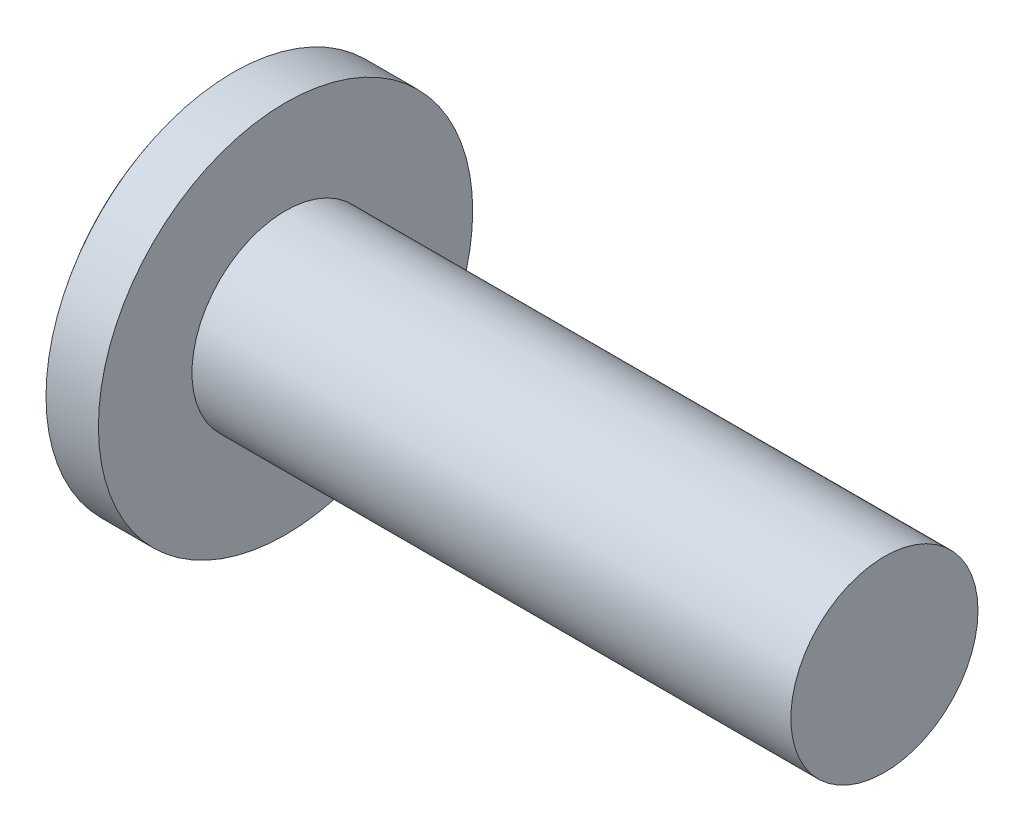
ISO-10303-21;
HEADER;
FILE_DESCRIPTION(('STEP AP214'),'2;1');
FILE_NAME('part.step','',(''),(''),'','','');
FILE_SCHEMA(('AUTOMOTIVE_DESIGN { 1 0 10303 214 1 1 1 1 }'));
ENDSEC;
DATA;
#1=APPLICATION_CONTEXT('core data for automotive mechanical design processes');
#2=APPLICATION_PROTOCOL_DEFINITION('international standard','automotive_design',2000,#1);
#3=PRODUCT_CONTEXT('',#1,'mechanical');
#4=PRODUCT('Part','Part','',(#3));
#5=PRODUCT_RELATED_PRODUCT_CATEGORY('part','',(#4));
#6=PRODUCT_DEFINITION_FORMATION('','',#4);
#7=PRODUCT_DEFINITION_CONTEXT('part definition',#1,'design');
#8=PRODUCT_DEFINITION('design','',#6,#7);
#9=PRODUCT_DEFINITION_SHAPE('','',#8);
#10=(LENGTH_UNIT() NAMED_UNIT(*) SI_UNIT(.MILLI.,.METRE.));
#11=(NAMED_UNIT(*) PLANE_ANGLE_UNIT() SI_UNIT($,.RADIAN.));
#12=(NAMED_UNIT(*) SI_UNIT($,.STERADIAN.) SOLID_ANGLE_UNIT());
#13=UNCERTAINTY_MEASURE_WITH_UNIT(LENGTH_MEASURE(1.E-05),#10,'distance_accuracy_value','');
#14=(GEOMETRIC_REPRESENTATION_CONTEXT(3) GLOBAL_UNCERTAINTY_ASSIGNED_CONTEXT((#13)) GLOBAL_UNIT_ASSIGNED_CONTEXT((#10,
#11,#12)) REPRESENTATION_CONTEXT('',''));
#15=CARTESIAN_POINT('',(0.,0.,0.));
#16=DIRECTION('',(0.,0.,1.));
#17=DIRECTION('',(1.,0.,0.));
#18=AXIS2_PLACEMENT_3D('',#15,#16,#17);
#19=CARTESIAN_POINT('',(1.5,-0.13,-0.26));
#20=DIRECTION('',(-0.569779621770595,0.,0.821797531399893));
#21=DIRECTION('',(0.821797531399893,0.,0.569779621770595));
#22=AXIS2_PLACEMENT_3D('',#19,#20,#21);
#23=PLANE('',#22);
#24=CARTESIAN_POINT('',(0.313139293097391,0.13,-1.08289009011915));
#25=CARTESIAN_POINT('',(0.311541025470173,0.0866666666666669,-1.08399822234068));
#26=CARTESIAN_POINT('',(0.310741891656564,0.0433333333333334,-1.08455228845145));
#27=CARTESIAN_POINT('',(0.310741891656564,-0.0433333333333335,-1.08455228845145));
#28=CARTESIAN_POINT('',(0.311541025470173,-0.086666666666667,-1.08399822234068));
#29=CARTESIAN_POINT('',(0.313139293097391,-0.13,-1.08289009011915));
#30=B_SPLINE_CURVE_WITH_KNOTS('',3,(#24,#25,#26,#27,#28,#29),.UNSPECIFIED.,.F.,.F.,(4,2,4),(0.,
0.130032728330081,0.260065456660161),.UNSPECIFIED.);
#31=CARTESIAN_POINT('',(0.313139293097366,0.13,-1.08289009011909));
#32=VERTEX_POINT('',#31);
#33=CARTESIAN_POINT('',(0.313139293097366,-0.13,-1.08289009011909));
#34=VERTEX_POINT('',#33);
#35=EDGE_CURVE('E21',#32,#34,#30,.T.);
#36=ORIENTED_EDGE('',*,*,#35,.T.);
#37=DIRECTION('',(-0.821797531399938,0.,-0.569779621770529));
#38=VECTOR('',#37,1.);
#39=CARTESIAN_POINT('',(1.5,-0.13,-0.26));
#40=LINE('',#39,#38);
#41=CARTESIAN_POINT('',(1.5,-0.13,-0.26));
#42=VERTEX_POINT('',#41);
#43=EDGE_CURVE('E125',#42,#34,#40,.T.);
#44=ORIENTED_EDGE('',*,*,#43,.F.);
#45=DIRECTION('',(0.,1.,0.));
#46=VECTOR('',#45,1.);
#47=CARTESIAN_POINT('',(1.5,-0.26,-0.26));
#48=LINE('',#47,#46);
#49=CARTESIAN_POINT('',(1.5,0.13,-0.26));
#50=VERTEX_POINT('',#49);
#51=EDGE_CURVE('E323',#50,#42,#48,.F.);
#52=ORIENTED_EDGE('',*,*,#51,.F.);
#53=DIRECTION('',(0.821797531399938,0.,0.569779621770529));
#54=VECTOR('',#53,1.);
#55=CARTESIAN_POINT('',(0.313139293097342,0.13,-1.08289009011904));
#56=LINE('',#55,#54);
#57=EDGE_CURVE('E128',#32,#50,#56,.T.);
#58=ORIENTED_EDGE('',*,*,#57,.F.);
#59=EDGE_LOOP('',(#36,#44,#52,#58));
#60=FACE_BOUND('',#59,.T.);
#61=ADVANCED_FACE('F17',(#60),#23,.T.);
#62=CARTESIAN_POINT('',(0.298849310573298,-1.09279781133585,-0.13));
#63=DIRECTION('',(-0.569779621770595,0.821797531399893,0.));
#64=DIRECTION('',(-0.821797531399893,-0.569779621770595,0.));
#65=AXIS2_PLACEMENT_3D('',#62,#63,#64);
#66=PLANE('',#65);
#67=DIRECTION('',(0.,0.,1.));
#68=VECTOR('',#67,1.);
#69=CARTESIAN_POINT('',(1.5,-0.259999999999999,-0.26));
#70=LINE('',#69,#68);
#71=CARTESIAN_POINT('',(1.5,-0.259999999999999,-0.13));
#72=VERTEX_POINT('',#71);
#73=CARTESIAN_POINT('',(1.5,-0.259999999999999,0.13));
#74=VERTEX_POINT('',#73);
#75=EDGE_CURVE('E338',#72,#74,#70,.T.);
#76=ORIENTED_EDGE('',*,*,#75,.F.);
#77=DIRECTION('',(0.821797531399937,0.569779621770531,0.));
#78=VECTOR('',#77,1.);
#79=CARTESIAN_POINT('',(0.313139293097331,-1.08289009011905,-0.13));
#80=LINE('',#79,#78);
#81=CARTESIAN_POINT('',(0.313139293097347,-1.08289009011911,-0.130000000000001));
#82=VERTEX_POINT('',#81);
#83=EDGE_CURVE('E289',#82,#72,#80,.T.);
#84=ORIENTED_EDGE('',*,*,#83,.F.);
#85=CARTESIAN_POINT('',(0.313139293097362,-1.08289009011917,-0.130000000000002));
#86=CARTESIAN_POINT('',(0.312340594801891,-1.08344385427069,-0.108344232257433));
#87=CARTESIAN_POINT('',(0.311741462200754,-1.08385925287415,-0.0866830150528154));
#88=CARTESIAN_POINT('',(0.310942328387147,-1.08441331898491,-0.0433496817194814));
#89=CARTESIAN_POINT('',(0.310742327174677,-1.08455198649223,-0.0216775655907653));
#90=CARTESIAN_POINT('',(0.310741891656542,-1.08455228845147,0.));
#91=B_SPLINE_CURVE_WITH_KNOTS('',3,(#85,#86,#87,#88,#89,#90),.UNSPECIFIED.,.F.,.F.,(4,2,4),(0.,
0.0650204477063345,0.130040895412669),.UNSPECIFIED.);
#92=CARTESIAN_POINT('',(0.310741891656483,-1.08455228845132,0.));
#93=VERTEX_POINT('',#92);
#94=EDGE_CURVE('E130',#82,#93,#91,.T.);
#95=ORIENTED_EDGE('',*,*,#94,.T.);
#96=CARTESIAN_POINT('',(0.310741891656541,-1.08455228845147,0.));
#97=CARTESIAN_POINT('',(0.310742327174677,-1.08455198649223,0.0216775655907652));
#98=CARTESIAN_POINT('',(0.310942328387147,-1.08441331898491,0.0433496817194814));
#99=CARTESIAN_POINT('',(0.311741462200753,-1.08385925287415,0.0866830150528153));
#100=CARTESIAN_POINT('',(0.312340594801891,-1.08344385427069,0.108344232257433));
#101=CARTESIAN_POINT('',(0.313139293097362,-1.08289009011917,0.130000000000002));
#102=B_SPLINE_CURVE_WITH_KNOTS('',3,(#96,#97,#98,#99,#100,#101),.UNSPECIFIED.,.F.,.F.,(4,2,4),
(0.,0.0650204477063345,0.130040895412669),.UNSPECIFIED.);
#103=CARTESIAN_POINT('',(0.313139293097347,-1.08289009011911,0.130000000000001));
#104=VERTEX_POINT('',#103);
#105=EDGE_CURVE('E204',#93,#104,#102,.T.);
#106=ORIENTED_EDGE('',*,*,#105,.T.);
#107=DIRECTION('',(-0.821797531399937,-0.569779621770531,0.));
#108=VECTOR('',#107,1.);
#109=CARTESIAN_POINT('',(1.5,-0.259999999999999,0.13));
#110=LINE('',#109,#108);
#111=EDGE_CURVE('E335',#74,#104,#110,.T.);
#112=ORIENTED_EDGE('',*,*,#111,.F.);
#113=EDGE_LOOP('',(#76,#84,#95,#106,#112));
#114=FACE_BOUND('',#113,.T.);
#115=ADVANCED_FACE('F189',(#114),#66,.T.);
#116=CARTESIAN_POINT('',(1.5,0.26,-0.13));
#117=DIRECTION('',(-0.569779621770595,-0.821797531399893,0.));
#118=DIRECTION('',(0.821797531399893,-0.569779621770595,0.));
#119=AXIS2_PLACEMENT_3D('',#116,#117,#118);
#120=PLANE('',#119);
#121=CARTESIAN_POINT('',(0.310741891656542,1.08455228845147,0.));
#122=CARTESIAN_POINT('',(0.310742327174677,1.08455198649223,-0.0216775655907652));
#123=CARTESIAN_POINT('',(0.310942328387147,1.08441331898491,-0.0433496817194813));
#124=CARTESIAN_POINT('',(0.311741462200754,1.08385925287415,-0.0866830150528153));
#125=CARTESIAN_POINT('',(0.312340594801891,1.08344385427069,-0.108344232257433));
#126=CARTESIAN_POINT('',(0.313139293097362,1.08289009011917,-0.130000000000002));
#127=B_SPLINE_CURVE_WITH_KNOTS('',3,(#121,#122,#123,#124,#125,#126),.UNSPECIFIED.,.F.,.F.,(4,2,
4),(0.,0.0650204477063345,0.130040895412669),.UNSPECIFIED.);
#128=CARTESIAN_POINT('',(0.310741891656483,1.08455228845132,0.));
#129=VERTEX_POINT('',#128);
#130=CARTESIAN_POINT('',(0.313139293097347,1.08289009011911,-0.130000000000001));
#131=VERTEX_POINT('',#130);
#132=EDGE_CURVE('E193',#129,#131,#127,.T.);
#133=ORIENTED_EDGE('',*,*,#132,.T.);
#134=DIRECTION('',(-0.821797531399937,0.569779621770531,0.));
#135=VECTOR('',#134,1.);
#136=CARTESIAN_POINT('',(1.5,0.26,-0.13));
#137=LINE('',#136,#135);
#138=CARTESIAN_POINT('',(1.5,0.26,-0.13));
#139=VERTEX_POINT('',#138);
#140=EDGE_CURVE('E284',#139,#131,#137,.T.);
#141=ORIENTED_EDGE('',*,*,#140,.F.);
#142=DIRECTION('',(0.,0.,1.));
#143=VECTOR('',#142,1.);
#144=CARTESIAN_POINT('',(1.5,0.26,-0.26));
#145=LINE('',#144,#143);
#146=CARTESIAN_POINT('',(1.5,0.26,0.13));
#147=VERTEX_POINT('',#146);
#148=EDGE_CURVE('E321',#147,#139,#145,.F.);
#149=ORIENTED_EDGE('',*,*,#148,.F.);
#150=DIRECTION('',(0.821797531399937,-0.569779621770531,0.));
#151=VECTOR('',#150,1.);
#152=CARTESIAN_POINT('',(0.313139293097332,1.08289009011905,0.13));
#153=LINE('',#152,#151);
#154=CARTESIAN_POINT('',(0.313139293097347,1.08289009011911,0.130000000000001));
#155=VERTEX_POINT('',#154);
#156=EDGE_CURVE('E310',#155,#147,#153,.T.);
#157=ORIENTED_EDGE('',*,*,#156,.F.);
#158=CARTESIAN_POINT('',(0.313139293097362,1.08289009011917,0.130000000000002));
#159=CARTESIAN_POINT('',(0.312340594801891,1.08344385427069,0.108344232257433));
#160=CARTESIAN_POINT('',(0.311741462200754,1.08385925287415,0.0866830150528153));
#161=CARTESIAN_POINT('',(0.310942328387147,1.08441331898492,0.0433496817194814));
#162=CARTESIAN_POINT('',(0.310742327174677,1.08455198649223,0.0216775655907653));
#163=CARTESIAN_POINT('',(0.310741891656541,1.08455228845147,0.));
#164=B_SPLINE_CURVE_WITH_KNOTS('',3,(#158,#159,#160,#161,#162,#163),.UNSPECIFIED.,.F.,.F.,(4,2,
4),(0.,0.0650204477063344,0.130040895412669),.UNSPECIFIED.);
#165=EDGE_CURVE('E198',#155,#129,#164,.T.);
#166=ORIENTED_EDGE('',*,*,#165,.T.);
#167=EDGE_LOOP('',(#133,#141,#149,#157,#166));
#168=FACE_BOUND('',#167,.T.);
#169=ADVANCED_FACE('F184',(#168),#120,.T.);
#170=CARTESIAN_POINT('',(1.5,-0.26,-0.26));
#171=DIRECTION('',(-1.,0.,0.));
#172=DIRECTION('',(0.,0.,1.));
#173=AXIS2_PLACEMENT_3D('',#170,#171,#172);
#174=PLANE('',#173);
#175=DIRECTION('',(0.,0.,-1.));
#176=VECTOR('',#175,1.);
#177=CARTESIAN_POINT('',(1.5,0.13,1.09241899102019));
#178=LINE('',#177,#176);
#179=CARTESIAN_POINT('',(1.5,0.13,0.13));
#180=VERTEX_POINT('',#179);
#181=CARTESIAN_POINT('',(1.5,0.13,0.259999999999998));
#182=VERTEX_POINT('',#181);
#183=EDGE_CURVE('E309',#180,#182,#178,.F.);
#184=ORIENTED_EDGE('',*,*,#183,.F.);
#185=DIRECTION('',(0.,1.,0.));
#186=VECTOR('',#185,1.);
#187=CARTESIAN_POINT('',(1.5,0.13,0.13));
#188=LINE('',#187,#186);
#189=EDGE_CURVE('E306',#147,#180,#188,.F.);
#190=ORIENTED_EDGE('',*,*,#189,.F.);
#191=ORIENTED_EDGE('',*,*,#148,.T.);
#192=DIRECTION('',(0.,1.,0.));
#193=VECTOR('',#192,1.);
#194=CARTESIAN_POINT('',(1.5,0.13,-0.13));
#195=LINE('',#194,#193);
#196=CARTESIAN_POINT('',(1.5,0.13,-0.13));
#197=VERTEX_POINT('',#196);
#198=EDGE_CURVE('E286',#197,#139,#195,.T.);
#199=ORIENTED_EDGE('',*,*,#198,.F.);
#200=DIRECTION('',(0.,0.,-1.));
#201=VECTOR('',#200,1.);
#202=CARTESIAN_POINT('',(1.5,0.13,-0.13));
#203=LINE('',#202,#201);
#204=EDGE_CURVE('E298',#50,#197,#203,.F.);
#205=ORIENTED_EDGE('',*,*,#204,.F.);
#206=ORIENTED_EDGE('',*,*,#51,.T.);
#207=DIRECTION('',(0.,0.,1.));
#208=VECTOR('',#207,1.);
#209=CARTESIAN_POINT('',(1.5,-0.13,-0.13));
#210=LINE('',#209,#208);
#211=CARTESIAN_POINT('',(1.5,-0.13,-0.13));
#212=VERTEX_POINT('',#211);
#213=EDGE_CURVE('E136',#212,#42,#210,.F.);
#214=ORIENTED_EDGE('',*,*,#213,.F.);
#215=DIRECTION('',(0.,1.,0.));
#216=VECTOR('',#215,1.);
#217=CARTESIAN_POINT('',(1.5,-1.09241899102019,-0.13));
#218=LINE('',#217,#216);
#219=EDGE_CURVE('E342',#72,#212,#218,.T.);
#220=ORIENTED_EDGE('',*,*,#219,.F.);
#221=ORIENTED_EDGE('',*,*,#75,.T.);
#222=DIRECTION('',(0.,1.,0.));
#223=VECTOR('',#222,1.);
#224=CARTESIAN_POINT('',(1.5,-1.09241899102019,0.13));
#225=LINE('',#224,#223);
#226=CARTESIAN_POINT('',(1.5,-0.13,0.13));
#227=VERTEX_POINT('',#226);
#228=EDGE_CURVE('E329',#227,#74,#225,.F.);
#229=ORIENTED_EDGE('',*,*,#228,.F.);
#230=DIRECTION('',(0.,0.,1.));
#231=VECTOR('',#230,1.);
#232=CARTESIAN_POINT('',(1.5,-0.13,1.09241899102019));
#233=LINE('',#232,#231);
#234=CARTESIAN_POINT('',(1.5,-0.13,0.259999999999998));
#235=VERTEX_POINT('',#234);
#236=EDGE_CURVE('E326',#235,#227,#233,.F.);
#237=ORIENTED_EDGE('',*,*,#236,.F.);
#238=DIRECTION('',(0.,1.,0.));
#239=VECTOR('',#238,1.);
#240=CARTESIAN_POINT('',(1.5,-0.13,0.259999999999996));
#241=LINE('',#240,#239);
#242=EDGE_CURVE('E317',#182,#235,#241,.F.);
#243=ORIENTED_EDGE('',*,*,#242,.F.);
#244=EDGE_LOOP('',(#184,#190,#191,#199,#205,#206,#214,#220,#221,#229,#237,#243));
#245=FACE_BOUND('',#244,.T.);
#246=ADVANCED_FACE('F180',(#245),#174,.T.);
#247=CARTESIAN_POINT('',(0.298848775638647,-0.13,1.09279818222387));
#248=DIRECTION('',(-0.569779621770595,0.,-0.821797531399893));
#249=DIRECTION('',(-0.821797531399893,0.,0.569779621770595));
#250=AXIS2_PLACEMENT_3D('',#247,#248,#249);
#251=PLANE('',#250);
#252=ORIENTED_EDGE('',*,*,#242,.T.);
#253=DIRECTION('',(0.821797531399938,0.,-0.56977962177053));
#254=VECTOR('',#253,1.);
#255=CARTESIAN_POINT('',(0.313139293097342,-0.13,1.08289009011904));
#256=LINE('',#255,#254);
#257=CARTESIAN_POINT('',(0.313139293097366,-0.13,1.08289009011909));
#258=VERTEX_POINT('',#257);
#259=EDGE_CURVE('E330',#258,#235,#256,.T.);
#260=ORIENTED_EDGE('',*,*,#259,.F.);
#261=CARTESIAN_POINT('',(0.313139293097389,-0.13,1.08289009011914));
#262=CARTESIAN_POINT('',(0.311541025470171,-0.0866666666666668,1.08399822234068));
#263=CARTESIAN_POINT('',(0.310741891656562,-0.0433333333333334,1.08455228845145));
#264=CARTESIAN_POINT('',(0.310741891656562,0.0433333333333335,1.08455228845145));
#265=CARTESIAN_POINT('',(0.311541025470171,0.0866666666666669,1.08399822234068));
#266=CARTESIAN_POINT('',(0.313139293097389,0.13,1.08289009011914));
#267=B_SPLINE_CURVE_WITH_KNOTS('',3,(#261,#262,#263,#264,#265,#266),.UNSPECIFIED.,.F.,.F.,(4,2,
4),(0.,0.13003272833008,0.260065456660161),.UNSPECIFIED.);
#268=CARTESIAN_POINT('',(0.313139293097366,0.13,1.08289009011909));
#269=VERTEX_POINT('',#268);
#270=EDGE_CURVE('E160',#258,#269,#267,.T.);
#271=ORIENTED_EDGE('',*,*,#270,.T.);
#272=DIRECTION('',(-0.821797531399938,0.,0.56977962177053));
#273=VECTOR('',#272,1.);
#274=CARTESIAN_POINT('',(1.5,0.13,0.259999999999999));
#275=LINE('',#274,#273);
#276=EDGE_CURVE('E148',#182,#269,#275,.T.);
#277=ORIENTED_EDGE('',*,*,#276,.F.);
#278=EDGE_LOOP('',(#252,#260,#271,#277));
#279=FACE_BOUND('',#278,.T.);
#280=ADVANCED_FACE('F174',(#279),#251,.T.);
#281=CARTESIAN_POINT('',(0.0373674350653901,-0.13,-0.13));
#282=DIRECTION('',(0.,1.,0.));
#283=DIRECTION('',(0.,0.,1.));
#284=AXIS2_PLACEMENT_3D('',#281,#282,#283);
#285=PLANE('',#284);
#286=ORIENTED_EDGE('',*,*,#43,.T.);
#287=CARTESIAN_POINT('',(0.037367435065386,-0.13,-0.130000000000001));
#288=CARTESIAN_POINT('',(0.0394971139768629,-0.13,-0.143668068066421));
#289=CARTESIAN_POINT('',(0.0417990975589028,-0.13,-0.15730744461169));
#290=CARTESIAN_POINT('',(0.0466746772806979,-0.13,-0.184536038525838));
#291=CARTESIAN_POINT('',(0.0492482391476004,-0.13,-0.198125262000487));
#292=CARTESIAN_POINT('',(0.0572662955433864,-0.13,-0.238826517677563));
#293=CARTESIAN_POINT('',(0.0630093634602951,-0.13,-0.265879350411103));
#294=CARTESIAN_POINT('',(0.0750458853952261,-0.13,-0.319793367199412));
#295=CARTESIAN_POINT('',(0.0813380013153635,-0.13,-0.346654853664737));
#296=CARTESIAN_POINT('',(0.0943964950787539,-0.13,-0.400264363030499));
#297=CARTESIAN_POINT('',(0.101162914096571,-0.13,-0.427012375865928));
#298=CARTESIAN_POINT('',(0.122089977935294,-0.13,-0.507040906890392));
#299=CARTESIAN_POINT('',(0.136889665283993,-0.13,-0.560155279986204));
#300=CARTESIAN_POINT('',(0.168037840469208,-0.13,-0.665908896850504));
#301=CARTESIAN_POINT('',(0.184385873624335,-0.13,-0.718548275161544));
#302=CARTESIAN_POINT('',(0.218596085497134,-0.13,-0.823397739494255));
#303=CARTESIAN_POINT('',(0.236459934534251,-0.13,-0.875607280534961));
#304=CARTESIAN_POINT('',(0.273687774914428,-0.13,-0.979602174325772));
#305=CARTESIAN_POINT('',(0.293054585554324,-0.13,-1.03138651804031));
#306=CARTESIAN_POINT('',(0.313139293097356,-0.13,-1.08289009011906));
#307=B_SPLINE_CURVE_WITH_KNOTS('',3,(#287,#288,#289,#290,#291,#292,#293,#294,#295,#296,#297,
#298,#299,#300,#301,#302,#303,#304,#305,#306),.UNSPECIFIED.,.F.,.F.,(4,2,2,2,2,2,2,2,2,4),(0.,
0.0414951882620653,0.0829851461296416,0.165943128129738,0.248704295113649,0.331472655567944,
0.49685757541919,0.662194078657266,0.827715197436683,0.993554680675719),.UNSPECIFIED.);
#308=CARTESIAN_POINT('',(0.0373674350653874,-0.13,-0.13));
#309=VERTEX_POINT('',#308);
#310=EDGE_CURVE('E134',#309,#34,#307,.T.);
#311=ORIENTED_EDGE('',*,*,#310,.F.);
#312=DIRECTION('',(1.,0.,0.));
#313=VECTOR('',#312,1.);
#314=CARTESIAN_POINT('',(0.0373674350653901,-0.13,-0.13));
#315=LINE('',#314,#313);
#316=EDGE_CURVE('E287',#212,#309,#315,.F.);
#317=ORIENTED_EDGE('',*,*,#316,.F.);
#318=ORIENTED_EDGE('',*,*,#213,.T.);
#319=EDGE_LOOP('',(#286,#311,#317,#318));
#320=FACE_BOUND('',#319,.T.);
#321=ADVANCED_FACE('F132',(#320),#285,.T.);
#322=CARTESIAN_POINT('',(0.0373674350653901,0.13,-0.13));
#323=DIRECTION('',(0.,-1.,0.));
#324=DIRECTION('',(0.,0.,-1.));
#325=AXIS2_PLACEMENT_3D('',#322,#323,#324);
#326=PLANE('',#325);
#327=ORIENTED_EDGE('',*,*,#204,.T.);
#328=DIRECTION('',(1.,0.,0.));
#329=VECTOR('',#328,1.);
#330=CARTESIAN_POINT('',(0.0373674350653901,0.13,-0.13));
#331=LINE('',#330,#329);
#332=CARTESIAN_POINT('',(0.0373674350653874,0.13,-0.13));
#333=VERTEX_POINT('',#332);
#334=EDGE_CURVE('E282',#333,#197,#331,.T.);
#335=ORIENTED_EDGE('',*,*,#334,.F.);
#336=CARTESIAN_POINT('',(0.313139293097357,0.13,-1.08289009011906));
#337=CARTESIAN_POINT('',(0.293054585554324,0.13,-1.03138651804031));
#338=CARTESIAN_POINT('',(0.273687774914428,0.13,-0.979602174325772));
#339=CARTESIAN_POINT('',(0.236459934534251,0.13,-0.875607280534961));
#340=CARTESIAN_POINT('',(0.218596085497134,0.13,-0.823397739494255));
#341=CARTESIAN_POINT('',(0.184385873624335,0.13,-0.718548275161544));
#342=CARTESIAN_POINT('',(0.168037840469208,0.13,-0.665908896850504));
#343=CARTESIAN_POINT('',(0.136889665283993,0.13,-0.560155279986204));
#344=CARTESIAN_POINT('',(0.122089977935294,0.13,-0.507040906890392));
#345=CARTESIAN_POINT('',(0.101162914096571,0.13,-0.427012375865928));
#346=CARTESIAN_POINT('',(0.0943964950787539,0.13,-0.400264363030499));
#347=CARTESIAN_POINT('',(0.0813380013153635,0.13,-0.346654853664737));
#348=CARTESIAN_POINT('',(0.0750458853952262,0.13,-0.319793367199412));
#349=CARTESIAN_POINT('',(0.0630093634602951,0.13,-0.265879350411103));
#350=CARTESIAN_POINT('',(0.0572662955433864,0.13,-0.238826517677563));
#351=CARTESIAN_POINT('',(0.0492482391476004,0.13,-0.198125262000487));
#352=CARTESIAN_POINT('',(0.0466746772806979,0.13,-0.184536038525838));
#353=CARTESIAN_POINT('',(0.0417990975589028,0.13,-0.15730744461169));
#354=CARTESIAN_POINT('',(0.0394971139768629,0.13,-0.143668068066421));
#355=CARTESIAN_POINT('',(0.037367435065386,0.13,-0.130000000000001));
#356=B_SPLINE_CURVE_WITH_KNOTS('',3,(#336,#337,#338,#339,#340,#341,#342,#343,#344,#345,#346,
#347,#348,#349,#350,#351,#352,#353,#354,#355),.UNSPECIFIED.,.F.,.F.,(4,2,2,2,2,2,2,2,2,4),(0.,
0.165839483239036,0.331360602018453,0.496697105256529,0.662082025107775,0.74485038556207,
0.827611552545981,0.910569534546077,0.952059492413654,0.993554680675719),.UNSPECIFIED.);
#357=EDGE_CURVE('E142',#32,#333,#356,.T.);
#358=ORIENTED_EDGE('',*,*,#357,.F.);
#359=ORIENTED_EDGE('',*,*,#57,.T.);
#360=EDGE_LOOP('',(#327,#335,#358,#359));
#361=FACE_BOUND('',#360,.T.);
#362=ADVANCED_FACE('F173',(#361),#326,.T.);
#363=CARTESIAN_POINT('',(0.0373674350653901,0.13,-0.13));
#364=DIRECTION('',(0.,0.,1.));
#365=DIRECTION('',(1.,0.,0.));
#366=AXIS2_PLACEMENT_3D('',#363,#364,#365);
#367=PLANE('',#366);
#368=ORIENTED_EDGE('',*,*,#140,.T.);
#369=CARTESIAN_POINT('',(0.037367435065386,0.13,-0.13));
#370=CARTESIAN_POINT('',(0.0394971139768624,0.143668068066421,-0.13));
#371=CARTESIAN_POINT('',(0.0417990975589017,0.15730744461169,-0.13));
#372=CARTESIAN_POINT('',(0.0466746772806956,0.184536038525839,-0.13));
#373=CARTESIAN_POINT('',(0.0492482391475973,0.198125262000488,-0.13));
#374=CARTESIAN_POINT('',(0.0572662955433811,0.238826517677565,-0.13));
#375=CARTESIAN_POINT('',(0.0630093634602882,0.265879350411106,-0.13));
#376=CARTESIAN_POINT('',(0.075045885395216,0.319793367199416,-0.13));
#377=CARTESIAN_POINT('',(0.0813380013153517,0.346654853664741,-0.13));
#378=CARTESIAN_POINT('',(0.094396495078739,0.400264363030505,-0.13));
#379=CARTESIAN_POINT('',(0.101162914096555,0.427012375865935,-0.13));
#380=CARTESIAN_POINT('',(0.122089977935273,0.507040906890401,-0.13));
#381=CARTESIAN_POINT('',(0.13688966528397,0.560155279986213,-0.13));
#382=CARTESIAN_POINT('',(0.16803784046918,0.665908896850516,-0.13));
#383=CARTESIAN_POINT('',(0.184385873624305,0.718548275161557,-0.13));
#384=CARTESIAN_POINT('',(0.218596085497101,0.823397739494269,-0.13));
#385=CARTESIAN_POINT('',(0.236459934534219,0.875607280534976,-0.13));
#386=CARTESIAN_POINT('',(0.273687774914396,0.979602174325788,-0.13));
#387=CARTESIAN_POINT('',(0.293054585554293,1.03138651804033,-0.13));
#388=CARTESIAN_POINT('',(0.313139293097327,1.08289009011908,-0.13));
#389=B_SPLINE_CURVE_WITH_KNOTS('',3,(#369,#370,#371,#372,#373,#374,#375,#376,#377,#378,#379,
#380,#381,#382,#383,#384,#385,#386,#387,#388),.UNSPECIFIED.,.F.,.F.,(4,2,2,2,2,2,2,2,2,4),(0.,
0.0414951882620656,0.0829851461296424,0.165943128129739,0.248704295113652,0.331472655567947,
0.496857575419195,0.662194078657272,0.827715197436691,0.993554680675728),.UNSPECIFIED.);
#390=EDGE_CURVE('E145',#333,#131,#389,.T.);
#391=ORIENTED_EDGE('',*,*,#390,.F.);
#392=ORIENTED_EDGE('',*,*,#334,.T.);
#393=ORIENTED_EDGE('',*,*,#198,.T.);
#394=EDGE_LOOP('',(#368,#391,#392,#393));
#395=FACE_BOUND('',#394,.T.);
#396=ADVANCED_FACE('F268',(#395),#367,.T.);
#397=CARTESIAN_POINT('',(0.0373674350653901,-1.09241899102019,-0.13));
#398=DIRECTION('',(0.,0.,1.));
#399=DIRECTION('',(1.,0.,0.));
#400=AXIS2_PLACEMENT_3D('',#397,#398,#399);
#401=PLANE('',#400);
#402=ORIENTED_EDGE('',*,*,#83,.T.);
#403=ORIENTED_EDGE('',*,*,#219,.T.);
#404=ORIENTED_EDGE('',*,*,#316,.T.);
#405=CARTESIAN_POINT('',(0.313139293097327,-1.08289009011908,-0.13));
#406=CARTESIAN_POINT('',(0.293054585554293,-1.03138651804033,-0.13));
#407=CARTESIAN_POINT('',(0.273687774914395,-0.979602174325788,-0.13));
#408=CARTESIAN_POINT('',(0.236459934534219,-0.875607280534976,-0.13));
#409=CARTESIAN_POINT('',(0.218596085497101,-0.823397739494269,-0.13));
#410=CARTESIAN_POINT('',(0.184385873624305,-0.718548275161557,-0.13));
#411=CARTESIAN_POINT('',(0.16803784046918,-0.665908896850516,-0.13));
#412=CARTESIAN_POINT('',(0.13688966528397,-0.560155279986213,-0.13));
#413=CARTESIAN_POINT('',(0.122089977935273,-0.507040906890401,-0.13));
#414=CARTESIAN_POINT('',(0.101162914096555,-0.427012375865935,-0.13));
#415=CARTESIAN_POINT('',(0.0943964950787389,-0.400264363030505,-0.13));
#416=CARTESIAN_POINT('',(0.0813380013153517,-0.346654853664741,-0.13));
#417=CARTESIAN_POINT('',(0.0750458853952159,-0.319793367199415,-0.13));
#418=CARTESIAN_POINT('',(0.0630093634602881,-0.265879350411105,-0.13));
#419=CARTESIAN_POINT('',(0.0572662955433811,-0.238826517677565,-0.13));
#420=CARTESIAN_POINT('',(0.0492482391475972,-0.198125262000488,-0.13));
#421=CARTESIAN_POINT('',(0.0466746772806955,-0.184536038525839,-0.13));
#422=CARTESIAN_POINT('',(0.0417990975589017,-0.15730744461169,-0.13));
#423=CARTESIAN_POINT('',(0.0394971139768624,-0.143668068066421,-0.13));
#424=CARTESIAN_POINT('',(0.0373674350653859,-0.13,-0.13));
#425=B_SPLINE_CURVE_WITH_KNOTS('',3,(#405,#406,#407,#408,#409,#410,#411,#412,#413,#414,#415,
#416,#417,#418,#419,#420,#421,#422,#423,#424),.UNSPECIFIED.,.F.,.F.,(4,2,2,2,2,2,2,2,2,4),(0.,
0.165839483239038,0.331360602018456,0.496697105256533,0.662082025107781,0.744850385562076,
0.827611552545989,0.910569534546086,0.952059492413663,0.993554680675728),.UNSPECIFIED.);
#426=EDGE_CURVE('E141',#82,#309,#425,.T.);
#427=ORIENTED_EDGE('',*,*,#426,.F.);
#428=EDGE_LOOP('',(#402,#403,#404,#427));
#429=FACE_BOUND('',#428,.T.);
#430=ADVANCED_FACE('F263',(#429),#401,.T.);
#431=CARTESIAN_POINT('',(0.0373674350653901,-0.13,1.09241899102019));
#432=DIRECTION('',(0.,1.,0.));
#433=DIRECTION('',(0.,0.,1.));
#434=AXIS2_PLACEMENT_3D('',#431,#432,#433);
#435=PLANE('',#434);
#436=ORIENTED_EDGE('',*,*,#259,.T.);
#437=ORIENTED_EDGE('',*,*,#236,.T.);
#438=DIRECTION('',(-1.,0.,0.));
#439=VECTOR('',#438,1.);
#440=CARTESIAN_POINT('',(0.0373674350653901,-0.13,0.13));
#441=LINE('',#440,#439);
#442=CARTESIAN_POINT('',(0.0373674350653874,-0.13,0.13));
#443=VERTEX_POINT('',#442);
#444=EDGE_CURVE('E400',#443,#227,#441,.F.);
#445=ORIENTED_EDGE('',*,*,#444,.F.);
#446=CARTESIAN_POINT('',(0.313139293097356,-0.13,1.08289009011906));
#447=CARTESIAN_POINT('',(0.293054585554324,-0.13,1.03138651804031));
#448=CARTESIAN_POINT('',(0.273687774914428,-0.13,0.979602174325771));
#449=CARTESIAN_POINT('',(0.236459934534251,-0.13,0.87560728053496));
#450=CARTESIAN_POINT('',(0.218596085497134,-0.13,0.823397739494254));
#451=CARTESIAN_POINT('',(0.184385873624335,-0.13,0.718548275161543));
#452=CARTESIAN_POINT('',(0.168037840469209,-0.13,0.665908896850504));
#453=CARTESIAN_POINT('',(0.136889665283994,-0.13,0.560155279986204));
#454=CARTESIAN_POINT('',(0.122089977935295,-0.13,0.507040906890392));
#455=CARTESIAN_POINT('',(0.101162914096571,-0.13,0.427012375865928));
#456=CARTESIAN_POINT('',(0.0943964950787542,-0.13,0.400264363030499));
#457=CARTESIAN_POINT('',(0.0813380013153637,-0.13,0.346654853664737));
#458=CARTESIAN_POINT('',(0.0750458853952263,-0.13,0.319793367199412));
#459=CARTESIAN_POINT('',(0.0630093634602952,-0.13,0.265879350411103));
#460=CARTESIAN_POINT('',(0.0572662955433866,-0.13,0.238826517677563));
#461=CARTESIAN_POINT('',(0.0492482391476005,-0.13,0.198125262000487));
#462=CARTESIAN_POINT('',(0.046674677280698,-0.13,0.184536038525838));
#463=CARTESIAN_POINT('',(0.0417990975589029,-0.13,0.15730744461169));
#464=CARTESIAN_POINT('',(0.039497113976863,-0.13,0.143668068066421));
#465=CARTESIAN_POINT('',(0.0373674350653861,-0.13,0.130000000000001));
#466=B_SPLINE_CURVE_WITH_KNOTS('',3,(#446,#447,#448,#449,#450,#451,#452,#453,#454,#455,#456,
#457,#458,#459,#460,#461,#462,#463,#464,#465),.UNSPECIFIED.,.F.,.F.,(4,2,2,2,2,2,2,2,2,4),(0.,
0.165839483239036,0.331360602018453,0.496697105256528,0.662082025107774,0.744850385562069,
0.827611552545981,0.910569534546077,0.952059492413653,0.993554680675718),.UNSPECIFIED.);
#467=EDGE_CURVE('E248',#258,#443,#466,.T.);
#468=ORIENTED_EDGE('',*,*,#467,.F.);
#469=EDGE_LOOP('',(#436,#437,#445,#468));
#470=FACE_BOUND('',#469,.T.);
#471=ADVANCED_FACE('F259',(#470),#435,.T.);
#472=CARTESIAN_POINT('',(0.0373674350653901,-1.09241899102019,0.13));
#473=DIRECTION('',(0.,0.,-1.));
#474=DIRECTION('',(-1.,0.,0.));
#475=AXIS2_PLACEMENT_3D('',#472,#473,#474);
#476=PLANE('',#475);
#477=CARTESIAN_POINT('',(0.037367435065386,-0.13,0.13));
#478=CARTESIAN_POINT('',(0.0394971139768625,-0.143668068066421,0.13));
#479=CARTESIAN_POINT('',(0.0417990975589018,-0.15730744461169,0.13));
#480=CARTESIAN_POINT('',(0.0466746772806957,-0.184536038525839,0.13));
#481=CARTESIAN_POINT('',(0.0492482391475974,-0.198125262000488,0.13));
#482=CARTESIAN_POINT('',(0.0572662955433812,-0.238826517677565,0.13));
#483=CARTESIAN_POINT('',(0.0630093634602882,-0.265879350411106,0.13));
#484=CARTESIAN_POINT('',(0.075045885395216,-0.319793367199416,0.13));
#485=CARTESIAN_POINT('',(0.0813380013153517,-0.346654853664741,0.13));
#486=CARTESIAN_POINT('',(0.0943964950787389,-0.400264363030505,0.13));
#487=CARTESIAN_POINT('',(0.101162914096555,-0.427012375865935,0.13));
#488=CARTESIAN_POINT('',(0.122089977935273,-0.507040906890401,0.13));
#489=CARTESIAN_POINT('',(0.13688966528397,-0.560155279986213,0.13));
#490=CARTESIAN_POINT('',(0.16803784046918,-0.665908896850516,0.13));
#491=CARTESIAN_POINT('',(0.184385873624305,-0.718548275161556,0.13));
#492=CARTESIAN_POINT('',(0.218596085497101,-0.823397739494269,0.13));
#493=CARTESIAN_POINT('',(0.236459934534218,-0.875607280534976,0.13));
#494=CARTESIAN_POINT('',(0.273687774914395,-0.979602174325788,0.13));
#495=CARTESIAN_POINT('',(0.293054585554293,-1.03138651804033,0.13));
#496=CARTESIAN_POINT('',(0.313139293097327,-1.08289009011907,0.13));
#497=B_SPLINE_CURVE_WITH_KNOTS('',3,(#477,#478,#479,#480,#481,#482,#483,#484,#485,#486,#487,
#488,#489,#490,#491,#492,#493,#494,#495,#496),.UNSPECIFIED.,.F.,.F.,(4,2,2,2,2,2,2,2,2,4),(0.,
0.0414951882620657,0.0829851461296424,0.165943128129739,0.248704295113652,0.331472655567947,
0.496857575419194,0.662194078657272,0.82771519743669,0.993554680675728),.UNSPECIFIED.);
#498=EDGE_CURVE('E226',#443,#104,#497,.T.);
#499=ORIENTED_EDGE('',*,*,#498,.F.);
#500=ORIENTED_EDGE('',*,*,#444,.T.);
#501=ORIENTED_EDGE('',*,*,#228,.T.);
#502=ORIENTED_EDGE('',*,*,#111,.T.);
#503=EDGE_LOOP('',(#499,#500,#501,#502));
#504=FACE_BOUND('',#503,.T.);
#505=ADVANCED_FACE('F262',(#504),#476,.T.);
#506=CARTESIAN_POINT('',(0.0373674350653801,0.13,0.13));
#507=DIRECTION('',(0.,0.,-1.));
#508=DIRECTION('',(-1.,0.,0.));
#509=AXIS2_PLACEMENT_3D('',#506,#507,#508);
#510=PLANE('',#509);
#511=ORIENTED_EDGE('',*,*,#189,.T.);
#512=DIRECTION('',(1.,0.,0.));
#513=VECTOR('',#512,1.);
#514=CARTESIAN_POINT('',(0.0373674350653801,0.13,0.13));
#515=LINE('',#514,#513);
#516=CARTESIAN_POINT('',(0.0373674350653839,0.13,0.13));
#517=VERTEX_POINT('',#516);
#518=EDGE_CURVE('E143',#517,#180,#515,.T.);
#519=ORIENTED_EDGE('',*,*,#518,.F.);
#520=CARTESIAN_POINT('',(0.313139293097327,1.08289009011908,0.13));
#521=CARTESIAN_POINT('',(0.293054585554293,1.03138651804033,0.13));
#522=CARTESIAN_POINT('',(0.273687774914395,0.979602174325789,0.13));
#523=CARTESIAN_POINT('',(0.236459934534218,0.875607280534976,0.13));
#524=CARTESIAN_POINT('',(0.218596085497101,0.823397739494269,0.13));
#525=CARTESIAN_POINT('',(0.184385873624305,0.718548275161557,0.13));
#526=CARTESIAN_POINT('',(0.16803784046918,0.665908896850516,0.13));
#527=CARTESIAN_POINT('',(0.13688966528397,0.560155279986213,0.13));
#528=CARTESIAN_POINT('',(0.122089977935273,0.507040906890401,0.13));
#529=CARTESIAN_POINT('',(0.101162914096555,0.427012375865934,0.13));
#530=CARTESIAN_POINT('',(0.0943964950787388,0.400264363030504,0.13));
#531=CARTESIAN_POINT('',(0.0813380013153516,0.346654853664741,0.13));
#532=CARTESIAN_POINT('',(0.0750458853952159,0.319793367199415,0.13));
#533=CARTESIAN_POINT('',(0.0630093634602881,0.265879350411105,0.13));
#534=CARTESIAN_POINT('',(0.0572662955433811,0.238826517677565,0.13));
#535=CARTESIAN_POINT('',(0.0492482391475972,0.198125262000488,0.13));
#536=CARTESIAN_POINT('',(0.0466746772806955,0.184536038525838,0.13));
#537=CARTESIAN_POINT('',(0.0417990975589017,0.15730744461169,0.13));
#538=CARTESIAN_POINT('',(0.0394971139768624,0.14366806806642,0.13));
#539=CARTESIAN_POINT('',(0.037367435065386,0.13,0.13));
#540=B_SPLINE_CURVE_WITH_KNOTS('',3,(#520,#521,#522,#523,#524,#525,#526,#527,#528,#529,#530,
#531,#532,#533,#534,#535,#536,#537,#538,#539),.UNSPECIFIED.,.F.,.F.,(4,2,2,2,2,2,2,2,2,4),(0.,
0.165839483239038,0.331360602018456,0.496697105256534,0.662082025107781,0.744850385562077,
0.827611552545989,0.910569534546086,0.952059492413663,0.993554680675729),.UNSPECIFIED.);
#541=EDGE_CURVE('E242',#155,#517,#540,.T.);
#542=ORIENTED_EDGE('',*,*,#541,.F.);
#543=ORIENTED_EDGE('',*,*,#156,.T.);
#544=EDGE_LOOP('',(#511,#519,#542,#543));
#545=FACE_BOUND('',#544,.T.);
#546=ADVANCED_FACE('F507',(#545),#510,.T.);
#547=CARTESIAN_POINT('',(0.0373674350653801,0.13,1.09241899102019));
#548=DIRECTION('',(0.,-1.,0.));
#549=DIRECTION('',(0.,0.,-1.));
#550=AXIS2_PLACEMENT_3D('',#547,#548,#549);
#551=PLANE('',#550);
#552=CARTESIAN_POINT('',(0.0373674350653859,0.13,0.13));
#553=CARTESIAN_POINT('',(0.0394971139768628,0.13,0.14366806806642));
#554=CARTESIAN_POINT('',(0.0417990975589027,0.13,0.157307444611689));
#555=CARTESIAN_POINT('',(0.0466746772806978,0.13,0.184536038525837));
#556=CARTESIAN_POINT('',(0.0492482391476003,0.13,0.198125262000486));
#557=CARTESIAN_POINT('',(0.0572662955433863,0.13,0.238826517677562));
#558=CARTESIAN_POINT('',(0.063009363460295,0.13,0.265879350411102));
#559=CARTESIAN_POINT('',(0.0750458853952261,0.13,0.319793367199411));
#560=CARTESIAN_POINT('',(0.0813380013153635,0.13,0.346654853664736));
#561=CARTESIAN_POINT('',(0.0943964950787539,0.13,0.400264363030498));
#562=CARTESIAN_POINT('',(0.101162914096571,0.13,0.427012375865927));
#563=CARTESIAN_POINT('',(0.122089977935294,0.13,0.507040906890391));
#564=CARTESIAN_POINT('',(0.136889665283993,0.13,0.560155279986203));
#565=CARTESIAN_POINT('',(0.168037840469208,0.13,0.665908896850503));
#566=CARTESIAN_POINT('',(0.184385873624335,0.13,0.718548275161543));
#567=CARTESIAN_POINT('',(0.218596085497134,0.13,0.823397739494254));
#568=CARTESIAN_POINT('',(0.236459934534251,0.13,0.87560728053496));
#569=CARTESIAN_POINT('',(0.273687774914427,0.13,0.979602174325771));
#570=CARTESIAN_POINT('',(0.293054585554324,0.13,1.03138651804031));
#571=CARTESIAN_POINT('',(0.313139293097356,0.13,1.08289009011906));
#572=B_SPLINE_CURVE_WITH_KNOTS('',3,(#552,#553,#554,#555,#556,#557,#558,#559,#560,#561,#562,
#563,#564,#565,#566,#567,#568,#569,#570,#571),.UNSPECIFIED.,.F.,.F.,(4,2,2,2,2,2,2,2,2,4),(0.,
0.0414951882620653,0.0829851461296416,0.165943128129738,0.248704295113649,0.331472655567944,
0.49685757541919,0.662194078657266,0.827715197436683,0.993554680675719),.UNSPECIFIED.);
#573=EDGE_CURVE('E236',#517,#269,#572,.T.);
#574=ORIENTED_EDGE('',*,*,#573,.F.);
#575=ORIENTED_EDGE('',*,*,#518,.T.);
#576=ORIENTED_EDGE('',*,*,#183,.T.);
#577=ORIENTED_EDGE('',*,*,#276,.T.);
#578=EDGE_LOOP('',(#574,#575,#576,#577));
#579=FACE_BOUND('',#578,.T.);
#580=ADVANCED_FACE('F516',(#579),#551,.T.);
#581=CARTESIAN_POINT('',(1.09999999999994,2.50000000000005,0.));
#582=CARTESIAN_POINT('',(0.576781540956961,1.80328533636556,0.));
#583=CARTESIAN_POINT('',(0.215185634755661,1.0106322534344,0.));
#584=CARTESIAN_POINT('',(0.0319560853638027,0.158952117535507,0.));
#585=CARTESIAN_POINT('',(1.09999999999993,2.50000000000026,-1.47436312152807));
#586=CARTESIAN_POINT('',(0.57678154095696,1.80328533636598,-1.063478959012));
#587=CARTESIAN_POINT('',(0.215185634755661,1.01063225343444,-0.596015569556209));
#588=CARTESIAN_POINT('',(0.0319560853638037,0.158952117535515,-0.0937412560732547));
#589=CARTESIAN_POINT('',(1.09999999999993,1.45454128406506,-2.50000000000081));
#590=CARTESIAN_POINT('',(0.57678154095696,1.04918118747755,-1.80328533636555));
#591=CARTESIAN_POINT('',(0.215185634755661,0.588002534251343,-1.01063225343417));
#592=CARTESIAN_POINT('',(0.0319560853638036,0.0924809668579902,-0.158952117535498));
#593=CARTESIAN_POINT('',(1.09999999999994,0.,-2.50000000000082));
#594=CARTESIAN_POINT('',(0.576781540956961,0.,-1.80328533636555));
#595=CARTESIAN_POINT('',(0.21518563475566,0.,-1.01063225343416));
#596=CARTESIAN_POINT('',(0.0319560853638026,0.,-0.158952117535493));
#597=CARTESIAN_POINT('',(1.09999999999993,-1.45454128406506,-2.50000000000081));
#598=CARTESIAN_POINT('',(0.57678154095696,-1.04918118747755,-1.80328533636555));
#599=CARTESIAN_POINT('',(0.215185634755661,-0.588002534251343,-1.01063225343417));
#600=CARTESIAN_POINT('',(0.0319560853638036,-0.0924809668579902,-0.158952117535498));
#601=CARTESIAN_POINT('',(1.09999999999993,-2.50000000000026,-1.47436312152807));
#602=CARTESIAN_POINT('',(0.57678154095696,-1.80328533636598,-1.063478959012));
#603=CARTESIAN_POINT('',(0.215185634755661,-1.01063225343444,-0.59601556955621));
#604=CARTESIAN_POINT('',(0.0319560853638037,-0.158952117535515,-0.0937412560732547));
#605=CARTESIAN_POINT('',(1.09999999999994,-2.50000000000005,0.));
#606=CARTESIAN_POINT('',(0.576781540956961,-1.80328533636556,0.));
#607=CARTESIAN_POINT('',(0.215185634755661,-1.0106322534344,0.));
#608=CARTESIAN_POINT('',(0.0319560853638027,-0.158952117535507,0.));
#609=(BOUNDED_SURFACE() B_SPLINE_SURFACE(3,3,((#581,#582,#583,#584),(#585,#586,#587,#588),(#589,
#590,#591,#592),(#593,#594,#595,#596),(#597,#598,#599,#600),(#601,#602,#603,#604),(#605,#606,
#607,#608)),.UNSPECIFIED.,.F.,.F.,.F.) B_SPLINE_SURFACE_WITH_KNOTS((4,3,4),(4,4),
(0.0528160072593475,1.,1.94718399274065),(0.0193812807490297,0.990231093635795),
.UNSPECIFIED.) GEOMETRIC_REPRESENTATION_ITEM() RATIONAL_B_SPLINE_SURFACE(((1.16641331064418,
1.14850037696843,1.14867950630518,1.16695069865444),(0.947714646972974,0.93316032951136,
0.933305872685974,0.948151276496813),(0.960629677917258,0.945877020732816,0.946024547304657,
0.961072257632782),(1.20515840347703,1.1866504506328,1.18683553016124,1.20571364206235),
(0.960629677917258,0.945877020732816,0.946024547304657,0.961072257632782),(0.947714646972974,
0.93316032951136,0.933305872685974,0.948151276496813),(1.16641331064418,1.14850037696843,
1.14867950630518,1.16695069865444))) REPRESENTATION_ITEM('') SURFACE());
#610=CARTESIAN_POINT('',(1.09999999999994,2.50000000000005,0.));
#611=CARTESIAN_POINT('',(0.57678154095696,1.80328533636556,0.));
#612=CARTESIAN_POINT('',(0.21518563475566,1.0106322534344,0.));
#613=CARTESIAN_POINT('',(0.0319560853638023,0.158952117535505,0.));
#614=(BOUNDED_CURVE() B_SPLINE_CURVE(3,(#610,#611,#612,#613),.UNSPECIFIED.,.F.,
.F.) B_SPLINE_CURVE_WITH_KNOTS((4,4),(0.0193812807490297,0.990231093635796),
.UNSPECIFIED.) CURVE() GEOMETRIC_REPRESENTATION_ITEM() RATIONAL_B_SPLINE_CURVE((1.16641331064418,
1.14850037696843,1.14867950630518,1.16695069865444)) REPRESENTATION_ITEM(''));
#615=CARTESIAN_POINT('',(1.09999999999999,2.50000000000001,0.));
#616=VERTEX_POINT('',#615);
#617=EDGE_CURVE('E374',#616,#129,#614,.T.);
#618=CARTESIAN_POINT('',(1.1,0.,0.));
#619=DIRECTION('',(1.,0.,0.));
#620=DIRECTION('',(0.,0.,-1.));
#621=AXIS2_PLACEMENT_3D('',#618,#619,#620);
#622=CIRCLE('',#621,2.5);
#623=CARTESIAN_POINT('',(1.09999999999999,-2.50000000000001,0.));
#624=VERTEX_POINT('',#623);
#625=EDGE_CURVE('E41',#624,#616,#622,.T.);
#626=CARTESIAN_POINT('',(1.09999999999994,-2.50000000000005,0.));
#627=CARTESIAN_POINT('',(0.57678154095696,-1.80328533636556,0.));
#628=CARTESIAN_POINT('',(0.21518563475566,-1.0106322534344,0.));
#629=CARTESIAN_POINT('',(0.0319560853638023,-0.158952117535505,0.));
#630=(BOUNDED_CURVE() B_SPLINE_CURVE(3,(#626,#627,#628,#629),.UNSPECIFIED.,.F.,
.F.) B_SPLINE_CURVE_WITH_KNOTS((4,4),(0.0193812807490297,0.990231093635796),
.UNSPECIFIED.) CURVE() GEOMETRIC_REPRESENTATION_ITEM() RATIONAL_B_SPLINE_CURVE((1.16641331064418,
1.14850037696843,1.14867950630518,1.16695069865444)) REPRESENTATION_ITEM(''));
#631=EDGE_CURVE('E376',#93,#624,#630,.F.);
#632=ORIENTED_EDGE('',*,*,#94,.F.);
#633=ORIENTED_EDGE('',*,*,#426,.T.);
#634=ORIENTED_EDGE('',*,*,#310,.T.);
#635=ORIENTED_EDGE('',*,*,#35,.F.);
#636=ORIENTED_EDGE('',*,*,#357,.T.);
#637=ORIENTED_EDGE('',*,*,#390,.T.);
#638=ORIENTED_EDGE('',*,*,#132,.F.);
#639=ORIENTED_EDGE('',*,*,#617,.F.);
#640=ORIENTED_EDGE('',*,*,#625,.F.);
#641=ORIENTED_EDGE('',*,*,#631,.F.);
#642=EDGE_LOOP('',(#632,#633,#634,#635,#636,#637,#638,#639,#640,#641));
#643=FACE_BOUND('',#642,.T.);
#644=ADVANCED_FACE('F139',(#643),#609,.T.);
#645=CARTESIAN_POINT('',(1.09999999999994,-2.50000000000005,0.));
#646=CARTESIAN_POINT('',(0.57678154095696,-1.80328533636556,0.));
#647=CARTESIAN_POINT('',(0.21518563475566,-1.0106322534344,0.));
#648=CARTESIAN_POINT('',(0.0319560853638023,-0.158952117535505,0.));
#649=CARTESIAN_POINT('',(1.09999999999993,-2.50000000000026,1.47436312152807));
#650=CARTESIAN_POINT('',(0.57678154095696,-1.80328533636598,1.063478959012));
#651=CARTESIAN_POINT('',(0.215185634755661,-1.01063225343444,0.596015569556209));
#652=CARTESIAN_POINT('',(0.0319560853638033,-0.158952117535513,0.0937412560732535));
#653=CARTESIAN_POINT('',(1.09999999999993,-1.45454128406506,2.50000000000081));
#654=CARTESIAN_POINT('',(0.576781540956959,-1.04918118747755,1.80328533636555));
#655=CARTESIAN_POINT('',(0.215185634755661,-0.588002534251342,1.01063225343416));
#656=CARTESIAN_POINT('',(0.0319560853638032,-0.092480966857989,0.158952117535496));
#657=CARTESIAN_POINT('',(1.09999999999994,0.,2.50000000000082));
#658=CARTESIAN_POINT('',(0.57678154095696,0.,1.80328533636555));
#659=CARTESIAN_POINT('',(0.21518563475566,0.,1.01063225343416));
#660=CARTESIAN_POINT('',(0.0319560853638021,0.,0.158952117535491));
#661=CARTESIAN_POINT('',(1.09999999999993,1.45454128406506,2.50000000000081));
#662=CARTESIAN_POINT('',(0.576781540956959,1.04918118747755,1.80328533636555));
#663=CARTESIAN_POINT('',(0.215185634755661,0.588002534251342,1.01063225343416));
#664=CARTESIAN_POINT('',(0.0319560853638032,0.092480966857989,0.158952117535496));
#665=CARTESIAN_POINT('',(1.09999999999993,2.50000000000026,1.47436312152807));
#666=CARTESIAN_POINT('',(0.57678154095696,1.80328533636598,1.063478959012));
#667=CARTESIAN_POINT('',(0.215185634755661,1.01063225343444,0.596015569556209));
#668=CARTESIAN_POINT('',(0.0319560853638033,0.158952117535513,0.0937412560732535));
#669=CARTESIAN_POINT('',(1.09999999999994,2.50000000000005,0.));
#670=CARTESIAN_POINT('',(0.57678154095696,1.80328533636556,0.));
#671=CARTESIAN_POINT('',(0.21518563475566,1.0106322534344,0.));
#672=CARTESIAN_POINT('',(0.0319560853638023,0.158952117535505,0.));
#673=(BOUNDED_SURFACE() B_SPLINE_SURFACE(3,3,((#645,#646,#647,#648),(#649,#650,#651,#652),(#653,
#654,#655,#656),(#657,#658,#659,#660),(#661,#662,#663,#664),(#665,#666,#667,#668),(#669,#670,
#671,#672)),.UNSPECIFIED.,.F.,.F.,.F.) B_SPLINE_SURFACE_WITH_KNOTS((4,3,4),(4,4),
(0.0528160072593475,1.,1.94718399274065),(0.0193812807490297,0.990231093635796),
.UNSPECIFIED.) GEOMETRIC_REPRESENTATION_ITEM() RATIONAL_B_SPLINE_SURFACE(((1.16641331064418,
1.14850037696843,1.14867950630518,1.16695069865444),(0.947714646972974,0.93316032951136,
0.933305872685974,0.948151276496813),(0.960629677917258,0.945877020732816,0.946024547304657,
0.961072257632782),(1.20515840347703,1.1866504506328,1.18683553016124,1.20571364206235),
(0.960629677917258,0.945877020732816,0.946024547304657,0.961072257632782),(0.947714646972974,
0.93316032951136,0.933305872685974,0.948151276496813),(1.16641331064418,1.14850037696843,
1.14867950630518,1.16695069865444))) REPRESENTATION_ITEM('') SURFACE());
#674=CARTESIAN_POINT('',(1.1,0.,0.));
#675=DIRECTION('',(1.,0.,0.));
#676=DIRECTION('',(0.,0.,-1.));
#677=AXIS2_PLACEMENT_3D('',#674,#675,#676);
#678=CIRCLE('',#677,2.5);
#679=EDGE_CURVE('E361',#616,#624,#678,.T.);
#680=ORIENTED_EDGE('',*,*,#573,.T.);
#681=ORIENTED_EDGE('',*,*,#270,.F.);
#682=ORIENTED_EDGE('',*,*,#467,.T.);
#683=ORIENTED_EDGE('',*,*,#498,.T.);
#684=ORIENTED_EDGE('',*,*,#105,.F.);
#685=ORIENTED_EDGE('',*,*,#631,.T.);
#686=ORIENTED_EDGE('',*,*,#679,.F.);
#687=ORIENTED_EDGE('',*,*,#617,.T.);
#688=ORIENTED_EDGE('',*,*,#165,.F.);
#689=ORIENTED_EDGE('',*,*,#541,.T.);
#690=EDGE_LOOP('',(#680,#681,#682,#683,#684,#685,#686,#687,#688,#689));
#691=FACE_BOUND('',#690,.T.);
#692=ADVANCED_FACE('F208',(#691),#673,.T.);
#693=CARTESIAN_POINT('',(1.8,0.,0.));
#694=DIRECTION('',(-1.,0.,0.));
#695=DIRECTION('',(0.,0.,1.));
#696=AXIS2_PLACEMENT_3D('',#693,#694,#695);
#697=CYLINDRICAL_SURFACE('',#696,2.5);
#698=ORIENTED_EDGE('',*,*,#625,.T.);
#699=ORIENTED_EDGE('',*,*,#679,.T.);
#700=EDGE_LOOP('',(#698,#699));
#701=FACE_BOUND('',#700,.T.);
#702=CARTESIAN_POINT('',(1.8,0.,0.));
#703=DIRECTION('',(-1.,0.,0.));
#704=DIRECTION('',(0.,0.,1.));
#705=AXIS2_PLACEMENT_3D('',#702,#703,#704);
#706=CIRCLE('',#705,2.5);
#707=CARTESIAN_POINT('',(1.8,0.,2.5));
#708=VERTEX_POINT('',#707);
#709=EDGE_CURVE('E359',#708,#708,#706,.F.);
#710=ORIENTED_EDGE('',*,*,#709,.F.);
#711=EDGE_LOOP('',(#710));
#712=FACE_BOUND('',#711,.T.);
#713=ADVANCED_FACE('F214',(#701,#712),#697,.T.);
#714=CARTESIAN_POINT('',(1.8,-2.55,2.55));
#715=DIRECTION('',(1.,0.,0.));
#716=DIRECTION('',(0.,0.,-1.));
#717=AXIS2_PLACEMENT_3D('',#714,#715,#716);
#718=PLANE('',#717);
#719=CARTESIAN_POINT('',(1.8,0.,0.));
#720=DIRECTION('',(1.,0.,0.));
#721=DIRECTION('',(0.,0.,-1.));
#722=AXIS2_PLACEMENT_3D('',#719,#720,#721);
#723=CIRCLE('',#722,1.25);
#724=CARTESIAN_POINT('',(1.8,0.,-1.25));
#725=VERTEX_POINT('',#724);
#726=EDGE_CURVE('E32',#725,#725,#723,.T.);
#727=ORIENTED_EDGE('',*,*,#726,.F.);
#728=EDGE_LOOP('',(#727));
#729=FACE_BOUND('',#728,.T.);
#730=ORIENTED_EDGE('',*,*,#709,.T.);
#731=EDGE_LOOP('',(#730));
#732=FACE_BOUND('',#731,.T.);
#733=ADVANCED_FACE('F216',(#729,#732),#718,.T.);
#734=CARTESIAN_POINT('',(9.8,-1.275,-1.275));
#735=DIRECTION('',(1.,0.,0.));
#736=DIRECTION('',(0.,0.,-1.));
#737=AXIS2_PLACEMENT_3D('',#734,#735,#736);
#738=PLANE('',#737);
#739=CARTESIAN_POINT('',(9.8,0.,0.));
#740=DIRECTION('',(1.,0.,0.));
#741=DIRECTION('',(0.,0.,-1.));
#742=AXIS2_PLACEMENT_3D('',#739,#740,#741);
#743=CIRCLE('',#742,1.25);
#744=CARTESIAN_POINT('',(9.8,0.,-1.25));
#745=VERTEX_POINT('',#744);
#746=EDGE_CURVE('E11',#745,#745,#743,.F.);
#747=ORIENTED_EDGE('',*,*,#746,.F.);
#748=EDGE_LOOP('',(#747));
#749=FACE_BOUND('',#748,.T.);
#750=ADVANCED_FACE('F430',(#749),#738,.T.);
#751=CARTESIAN_POINT('',(1.8,0.,0.));
#752=DIRECTION('',(1.,0.,0.));
#753=DIRECTION('',(0.,0.,-1.));
#754=AXIS2_PLACEMENT_3D('',#751,#752,#753);
#755=CYLINDRICAL_SURFACE('',#754,1.25);
#756=ORIENTED_EDGE('',*,*,#746,.T.);
#757=EDGE_LOOP('',(#756));
#758=FACE_BOUND('',#757,.T.);
#759=ORIENTED_EDGE('',*,*,#726,.T.);
#760=EDGE_LOOP('',(#759));
#761=FACE_BOUND('',#760,.T.);
#762=ADVANCED_FACE('F19',(#758,#761),#755,.T.);
#763=CLOSED_SHELL('',(#61,#115,#169,#246,#280,#321,#362,#396,#430,#471,#505,#546,#580,#644,#692,
#713,#733,#750,#762));
#764=MANIFOLD_SOLID_BREP('B1',#763);
#765=ADVANCED_BREP_SHAPE_REPRESENTATION('',(#18,#764),#14);
#766=SHAPE_DEFINITION_REPRESENTATION(#9,#765);
ENDSEC;
END-ISO-10303-21;
